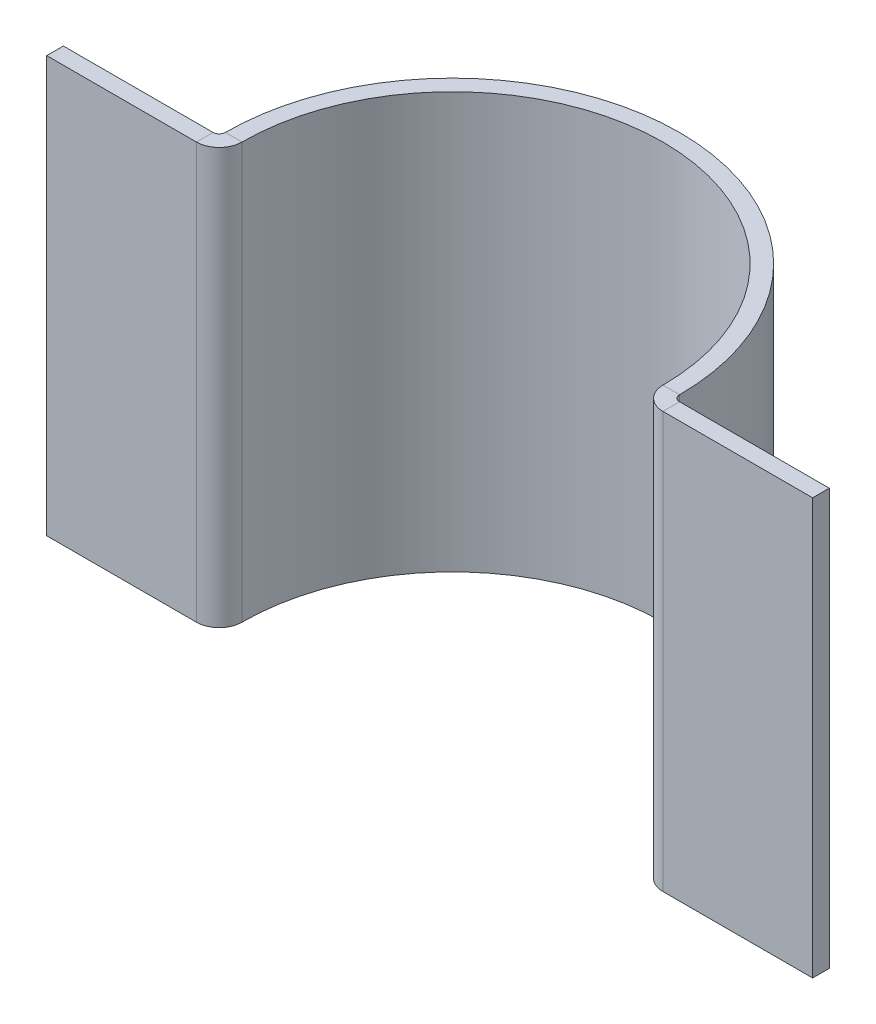
ISO-10303-21;
HEADER;
FILE_DESCRIPTION(('STEP AP214'),'2;1');
FILE_NAME('part.step','',(''),(''),'','','');
FILE_SCHEMA(('AUTOMOTIVE_DESIGN { 1 0 10303 214 1 1 1 1 }'));
ENDSEC;
DATA;
#1=APPLICATION_CONTEXT('core data for automotive mechanical design processes');
#2=APPLICATION_PROTOCOL_DEFINITION('international standard','automotive_design',2000,#1);
#3=PRODUCT_CONTEXT('',#1,'mechanical');
#4=PRODUCT('Part','Part','',(#3));
#5=PRODUCT_RELATED_PRODUCT_CATEGORY('part','',(#4));
#6=PRODUCT_DEFINITION_FORMATION('','',#4);
#7=PRODUCT_DEFINITION_CONTEXT('part definition',#1,'design');
#8=PRODUCT_DEFINITION('design','',#6,#7);
#9=PRODUCT_DEFINITION_SHAPE('','',#8);
#10=(LENGTH_UNIT() NAMED_UNIT(*) SI_UNIT(.MILLI.,.METRE.));
#11=(NAMED_UNIT(*) PLANE_ANGLE_UNIT() SI_UNIT($,.RADIAN.));
#12=(NAMED_UNIT(*) SI_UNIT($,.STERADIAN.) SOLID_ANGLE_UNIT());
#13=UNCERTAINTY_MEASURE_WITH_UNIT(LENGTH_MEASURE(1.E-05),#10,'distance_accuracy_value','');
#14=(GEOMETRIC_REPRESENTATION_CONTEXT(3) GLOBAL_UNCERTAINTY_ASSIGNED_CONTEXT((#13)) GLOBAL_UNIT_ASSIGNED_CONTEXT((#10,
#11,#12)) REPRESENTATION_CONTEXT('',''));
#15=CARTESIAN_POINT('',(0.,0.,0.));
#16=DIRECTION('',(0.,0.,1.));
#17=DIRECTION('',(1.,0.,0.));
#18=AXIS2_PLACEMENT_3D('',#15,#16,#17);
#19=CARTESIAN_POINT('',(0.,50.,0.));
#20=DIRECTION('',(0.,-1.,0.));
#21=DIRECTION('',(0.,0.,-1.));
#22=AXIS2_PLACEMENT_3D('',#19,#20,#21);
#23=CYLINDRICAL_SURFACE('',#22,27.3087417494406);
#24=CARTESIAN_POINT('',(0.,0.,0.));
#25=DIRECTION('',(0.,1.,0.));
#26=DIRECTION('',(1.,0.,0.));
#27=AXIS2_PLACEMENT_3D('',#24,#25,#26);
#28=CIRCLE('',#27,27.3087417494406);
#29=CARTESIAN_POINT('',(27.3087417494406,0.,0.));
#30=VERTEX_POINT('',#29);
#31=CARTESIAN_POINT('',(-27.3087417494406,0.,0.));
#32=VERTEX_POINT('',#31);
#33=EDGE_CURVE('E183',#30,#32,#28,.T.);
#34=ORIENTED_EDGE('',*,*,#33,.T.);
#35=DIRECTION('',(0.,-1.,0.));
#36=VECTOR('',#35,1.);
#37=CARTESIAN_POINT('',(-27.3087417494406,50.,0.));
#38=LINE('',#37,#36);
#39=CARTESIAN_POINT('',(-27.3087417494406,50.,0.));
#40=VERTEX_POINT('',#39);
#41=EDGE_CURVE('E13',#40,#32,#38,.T.);
#42=ORIENTED_EDGE('',*,*,#41,.F.);
#43=CARTESIAN_POINT('',(0.,50.,0.));
#44=DIRECTION('',(0.,1.,0.));
#45=DIRECTION('',(1.,0.,0.));
#46=AXIS2_PLACEMENT_3D('',#43,#44,#45);
#47=CIRCLE('',#46,27.3087417494406);
#48=CARTESIAN_POINT('',(27.3087417494406,50.,0.));
#49=VERTEX_POINT('',#48);
#50=EDGE_CURVE('E95',#49,#40,#47,.T.);
#51=ORIENTED_EDGE('',*,*,#50,.F.);
#52=DIRECTION('',(0.,-1.,0.));
#53=VECTOR('',#52,1.);
#54=CARTESIAN_POINT('',(27.3087417494406,50.,0.));
#55=LINE('',#54,#53);
#56=EDGE_CURVE('E197',#49,#30,#55,.T.);
#57=ORIENTED_EDGE('',*,*,#56,.T.);
#58=EDGE_LOOP('',(#34,#42,#51,#57));
#59=FACE_BOUND('',#58,.T.);
#60=ADVANCED_FACE('F79',(#59),#23,.T.);
#61=CARTESIAN_POINT('',(0.,50.,0.));
#62=DIRECTION('',(0.,-1.,0.));
#63=DIRECTION('',(0.,0.,-1.));
#64=AXIS2_PLACEMENT_3D('',#61,#62,#63);
#65=CYLINDRICAL_SURFACE('',#64,25.3087417494406);
#66=CARTESIAN_POINT('',(0.,0.,0.));
#67=DIRECTION('',(0.,1.,0.));
#68=DIRECTION('',(0.,0.,1.));
#69=AXIS2_PLACEMENT_3D('',#66,#67,#68);
#70=CIRCLE('',#69,25.3087417494406);
#71=CARTESIAN_POINT('',(25.3087417494406,0.,0.));
#72=VERTEX_POINT('',#71);
#73=CARTESIAN_POINT('',(-25.3087417494406,0.,0.));
#74=VERTEX_POINT('',#73);
#75=EDGE_CURVE('E203',#72,#74,#70,.T.);
#76=ORIENTED_EDGE('',*,*,#75,.F.);
#77=DIRECTION('',(0.,-1.,0.));
#78=VECTOR('',#77,1.);
#79=CARTESIAN_POINT('',(25.3087417494406,50.,0.));
#80=LINE('',#79,#78);
#81=CARTESIAN_POINT('',(25.3087417494406,50.,0.));
#82=VERTEX_POINT('',#81);
#83=EDGE_CURVE('E207',#82,#72,#80,.T.);
#84=ORIENTED_EDGE('',*,*,#83,.F.);
#85=CARTESIAN_POINT('',(0.,50.,0.));
#86=DIRECTION('',(0.,1.,0.));
#87=DIRECTION('',(0.,0.,1.));
#88=AXIS2_PLACEMENT_3D('',#85,#86,#87);
#89=CIRCLE('',#88,25.3087417494406);
#90=CARTESIAN_POINT('',(-25.3087417494406,50.,0.));
#91=VERTEX_POINT('',#90);
#92=EDGE_CURVE('E191',#82,#91,#89,.T.);
#93=ORIENTED_EDGE('',*,*,#92,.T.);
#94=DIRECTION('',(0.,-1.,0.));
#95=VECTOR('',#94,1.);
#96=CARTESIAN_POINT('',(-25.3087417494406,50.,0.));
#97=LINE('',#96,#95);
#98=EDGE_CURVE('E87',#91,#74,#97,.T.);
#99=ORIENTED_EDGE('',*,*,#98,.T.);
#100=EDGE_LOOP('',(#76,#84,#93,#99));
#101=FACE_BOUND('',#100,.T.);
#102=ADVANCED_FACE('F211',(#101),#65,.F.);
#103=CARTESIAN_POINT('',(0.,50.,0.));
#104=DIRECTION('',(0.,1.,0.));
#105=DIRECTION('',(1.,0.,0.));
#106=AXIS2_PLACEMENT_3D('',#103,#104,#105);
#107=PLANE('',#106);
#108=ORIENTED_EDGE('',*,*,#50,.T.);
#109=DIRECTION('',(-1.,0.,0.));
#110=VECTOR('',#109,1.);
#111=CARTESIAN_POINT('',(-25.3087417494406,50.,0.));
#112=LINE('',#111,#110);
#113=EDGE_CURVE('E188',#91,#40,#112,.T.);
#114=ORIENTED_EDGE('',*,*,#113,.F.);
#115=ORIENTED_EDGE('',*,*,#92,.F.);
#116=DIRECTION('',(-1.,0.,0.));
#117=VECTOR('',#116,1.);
#118=CARTESIAN_POINT('',(27.3087417494406,50.,0.));
#119=LINE('',#118,#117);
#120=EDGE_CURVE('E194',#49,#82,#119,.T.);
#121=ORIENTED_EDGE('',*,*,#120,.F.);
#122=EDGE_LOOP('',(#108,#114,#115,#121));
#123=FACE_BOUND('',#122,.T.);
#124=ADVANCED_FACE('F331',(#123),#107,.T.);
#125=CARTESIAN_POINT('',(0.,0.,0.));
#126=DIRECTION('',(0.,1.,0.));
#127=DIRECTION('',(1.,0.,0.));
#128=AXIS2_PLACEMENT_3D('',#125,#126,#127);
#129=PLANE('',#128);
#130=ORIENTED_EDGE('',*,*,#33,.F.);
#131=DIRECTION('',(-1.,0.,0.));
#132=VECTOR('',#131,1.);
#133=CARTESIAN_POINT('',(27.3087417494406,0.,0.));
#134=LINE('',#133,#132);
#135=EDGE_CURVE('E116',#30,#72,#134,.T.);
#136=ORIENTED_EDGE('',*,*,#135,.T.);
#137=ORIENTED_EDGE('',*,*,#75,.T.);
#138=DIRECTION('',(-1.,0.,0.));
#139=VECTOR('',#138,1.);
#140=CARTESIAN_POINT('',(-25.3087417494406,0.,0.));
#141=LINE('',#140,#139);
#142=EDGE_CURVE('E200',#74,#32,#141,.T.);
#143=ORIENTED_EDGE('',*,*,#142,.T.);
#144=EDGE_LOOP('',(#130,#136,#137,#143));
#145=FACE_BOUND('',#144,.T.);
#146=ADVANCED_FACE('F216',(#145),#129,.F.);
#147=CARTESIAN_POINT('',(28.0453417494406,50.,0.));
#148=DIRECTION('',(0.,1.,0.));
#149=DIRECTION('',(0.,0.,1.));
#150=AXIS2_PLACEMENT_3D('',#147,#148,#149);
#151=PLANE('',#150);
#152=DIRECTION('',(0.,0.,-1.));
#153=VECTOR('',#152,1.);
#154=CARTESIAN_POINT('',(28.0453417494406,50.,2.7366));
#155=LINE('',#154,#153);
#156=CARTESIAN_POINT('',(28.0453417494406,50.,0.7366));
#157=VERTEX_POINT('',#156);
#158=CARTESIAN_POINT('',(28.0453417494406,50.,2.7366));
#159=VERTEX_POINT('',#158);
#160=EDGE_CURVE('E143',#157,#159,#155,.F.);
#161=ORIENTED_EDGE('',*,*,#160,.F.);
#162=CARTESIAN_POINT('',(28.0453417494406,50.,0.));
#163=DIRECTION('',(0.,-1.,0.));
#164=DIRECTION('',(0.,0.,-1.));
#165=AXIS2_PLACEMENT_3D('',#162,#163,#164);
#166=CIRCLE('',#165,0.736600000000005);
#167=EDGE_CURVE('E137',#49,#157,#166,.F.);
#168=ORIENTED_EDGE('',*,*,#167,.F.);
#169=ORIENTED_EDGE('',*,*,#120,.T.);
#170=CARTESIAN_POINT('',(28.0453417494406,50.,0.));
#171=DIRECTION('',(0.,-1.,0.));
#172=DIRECTION('',(0.,0.,-1.));
#173=AXIS2_PLACEMENT_3D('',#170,#171,#172);
#174=CIRCLE('',#173,2.73660000000001);
#175=EDGE_CURVE('E180',#82,#159,#174,.F.);
#176=ORIENTED_EDGE('',*,*,#175,.T.);
#177=EDGE_LOOP('',(#161,#168,#169,#176));
#178=FACE_BOUND('',#177,.T.);
#179=ADVANCED_FACE('F237',(#178),#151,.T.);
#180=CARTESIAN_POINT('',(28.0453417494406,0.,0.));
#181=DIRECTION('',(0.,1.,0.));
#182=DIRECTION('',(0.,0.,1.));
#183=AXIS2_PLACEMENT_3D('',#180,#181,#182);
#184=PLANE('',#183);
#185=CARTESIAN_POINT('',(28.0453417494406,0.,0.));
#186=DIRECTION('',(0.,-1.,0.));
#187=DIRECTION('',(0.,0.,-1.));
#188=AXIS2_PLACEMENT_3D('',#185,#186,#187);
#189=CIRCLE('',#188,0.736600000000005);
#190=CARTESIAN_POINT('',(28.0453417494406,0.,0.736600000000008));
#191=VERTEX_POINT('',#190);
#192=EDGE_CURVE('E135',#191,#30,#189,.T.);
#193=ORIENTED_EDGE('',*,*,#192,.F.);
#194=DIRECTION('',(0.,0.,-1.));
#195=VECTOR('',#194,1.);
#196=CARTESIAN_POINT('',(28.0453417494406,0.,0.736600000000001));
#197=LINE('',#196,#195);
#198=CARTESIAN_POINT('',(28.0453417494406,0.,2.7366));
#199=VERTEX_POINT('',#198);
#200=EDGE_CURVE('E142',#191,#199,#197,.F.);
#201=ORIENTED_EDGE('',*,*,#200,.T.);
#202=CARTESIAN_POINT('',(28.0453417494406,0.,0.));
#203=DIRECTION('',(0.,-1.,0.));
#204=DIRECTION('',(0.,0.,-1.));
#205=AXIS2_PLACEMENT_3D('',#202,#203,#204);
#206=CIRCLE('',#205,2.73660000000001);
#207=EDGE_CURVE('E184',#199,#72,#206,.T.);
#208=ORIENTED_EDGE('',*,*,#207,.T.);
#209=ORIENTED_EDGE('',*,*,#135,.F.);
#210=EDGE_LOOP('',(#193,#201,#208,#209));
#211=FACE_BOUND('',#210,.T.);
#212=ADVANCED_FACE('F148',(#211),#184,.F.);
#213=CARTESIAN_POINT('',(28.0453417494406,0.,0.));
#214=DIRECTION('',(0.,-1.,0.));
#215=DIRECTION('',(0.,0.,1.));
#216=AXIS2_PLACEMENT_3D('',#213,#214,#215);
#217=CYLINDRICAL_SURFACE('',#216,2.73660000000001);
#218=ORIENTED_EDGE('',*,*,#83,.T.);
#219=ORIENTED_EDGE('',*,*,#207,.F.);
#220=DIRECTION('',(0.,-1.,0.));
#221=VECTOR('',#220,1.);
#222=CARTESIAN_POINT('',(28.0453417494406,50.,2.7366));
#223=LINE('',#222,#221);
#224=EDGE_CURVE('E164',#199,#159,#223,.F.);
#225=ORIENTED_EDGE('',*,*,#224,.T.);
#226=ORIENTED_EDGE('',*,*,#175,.F.);
#227=EDGE_LOOP('',(#218,#219,#225,#226));
#228=FACE_BOUND('',#227,.T.);
#229=ADVANCED_FACE('F328',(#228),#217,.T.);
#230=CARTESIAN_POINT('',(28.0453417494406,0.,0.));
#231=DIRECTION('',(0.,-1.,0.));
#232=DIRECTION('',(0.,0.,1.));
#233=AXIS2_PLACEMENT_3D('',#230,#231,#232);
#234=CYLINDRICAL_SURFACE('',#233,0.736600000000005);
#235=ORIENTED_EDGE('',*,*,#56,.F.);
#236=ORIENTED_EDGE('',*,*,#167,.T.);
#237=DIRECTION('',(0.,-1.,0.));
#238=VECTOR('',#237,1.);
#239=CARTESIAN_POINT('',(28.0453417494406,50.,0.736600000000001));
#240=LINE('',#239,#238);
#241=EDGE_CURVE('E131',#157,#191,#240,.T.);
#242=ORIENTED_EDGE('',*,*,#241,.T.);
#243=ORIENTED_EDGE('',*,*,#192,.T.);
#244=EDGE_LOOP('',(#235,#236,#242,#243));
#245=FACE_BOUND('',#244,.T.);
#246=ADVANCED_FACE('F134',(#245),#234,.F.);
#247=CARTESIAN_POINT('',(27.3087417494406,50.,2.7366));
#248=DIRECTION('',(0.,-1.,0.));
#249=DIRECTION('',(0.,0.,-1.));
#250=AXIS2_PLACEMENT_3D('',#247,#248,#249);
#251=PLANE('',#250);
#252=ORIENTED_EDGE('',*,*,#160,.T.);
#253=DIRECTION('',(-1.,0.,0.));
#254=VECTOR('',#253,1.);
#255=CARTESIAN_POINT('',(0.,50.,2.7365999999999));
#256=LINE('',#255,#254);
#257=CARTESIAN_POINT('',(46.0453417494406,50.,2.73660000000006));
#258=VERTEX_POINT('',#257);
#259=EDGE_CURVE('E172',#258,#159,#256,.T.);
#260=ORIENTED_EDGE('',*,*,#259,.F.);
#261=DIRECTION('',(0.,0.,-1.));
#262=VECTOR('',#261,1.);
#263=CARTESIAN_POINT('',(46.0453417494406,50.,2.73660000000006));
#264=LINE('',#263,#262);
#265=CARTESIAN_POINT('',(46.0453417494406,50.,0.736600000000062));
#266=VERTEX_POINT('',#265);
#267=EDGE_CURVE('E253',#258,#266,#264,.T.);
#268=ORIENTED_EDGE('',*,*,#267,.T.);
#269=DIRECTION('',(1.,0.,0.));
#270=VECTOR('',#269,1.);
#271=CARTESIAN_POINT('',(27.3087417494406,50.,0.736599999999997));
#272=LINE('',#271,#270);
#273=EDGE_CURVE('E170',#266,#157,#272,.F.);
#274=ORIENTED_EDGE('',*,*,#273,.T.);
#275=EDGE_LOOP('',(#252,#260,#268,#274));
#276=FACE_BOUND('',#275,.T.);
#277=ADVANCED_FACE('F242',(#276),#251,.F.);
#278=CARTESIAN_POINT('',(46.0453417494406,0.,2.73660000000006));
#279=DIRECTION('',(0.,1.,0.));
#280=DIRECTION('',(0.,0.,1.));
#281=AXIS2_PLACEMENT_3D('',#278,#279,#280);
#282=PLANE('',#281);
#283=ORIENTED_EDGE('',*,*,#200,.F.);
#284=DIRECTION('',(-1.,0.,0.));
#285=VECTOR('',#284,1.);
#286=CARTESIAN_POINT('',(46.0453417494406,0.,0.736600000000062));
#287=LINE('',#286,#285);
#288=CARTESIAN_POINT('',(46.0453417494406,0.,0.736600000000062));
#289=VERTEX_POINT('',#288);
#290=EDGE_CURVE('E160',#191,#289,#287,.F.);
#291=ORIENTED_EDGE('',*,*,#290,.T.);
#292=DIRECTION('',(0.,0.,-1.));
#293=VECTOR('',#292,1.);
#294=CARTESIAN_POINT('',(46.0453417494406,0.,2.73660000000006));
#295=LINE('',#294,#293);
#296=CARTESIAN_POINT('',(46.0453417494406,0.,2.73660000000006));
#297=VERTEX_POINT('',#296);
#298=EDGE_CURVE('E152',#297,#289,#295,.T.);
#299=ORIENTED_EDGE('',*,*,#298,.F.);
#300=DIRECTION('',(1.,0.,0.));
#301=VECTOR('',#300,1.);
#302=CARTESIAN_POINT('',(0.,0.,2.7365999999999));
#303=LINE('',#302,#301);
#304=EDGE_CURVE('E163',#199,#297,#303,.T.);
#305=ORIENTED_EDGE('',*,*,#304,.F.);
#306=EDGE_LOOP('',(#283,#291,#299,#305));
#307=FACE_BOUND('',#306,.T.);
#308=ADVANCED_FACE('F157',(#307),#282,.F.);
#309=CARTESIAN_POINT('',(0.,0.,2.7365999999999));
#310=DIRECTION('',(0.,0.,-1.));
#311=DIRECTION('',(-1.,0.,0.));
#312=AXIS2_PLACEMENT_3D('',#309,#310,#311);
#313=PLANE('',#312);
#314=ORIENTED_EDGE('',*,*,#224,.F.);
#315=ORIENTED_EDGE('',*,*,#304,.T.);
#316=DIRECTION('',(0.,1.,0.));
#317=VECTOR('',#316,1.);
#318=CARTESIAN_POINT('',(46.0453417494406,0.,2.73660000000006));
#319=LINE('',#318,#317);
#320=EDGE_CURVE('E248',#297,#258,#319,.T.);
#321=ORIENTED_EDGE('',*,*,#320,.T.);
#322=ORIENTED_EDGE('',*,*,#259,.T.);
#323=EDGE_LOOP('',(#314,#315,#321,#322));
#324=FACE_BOUND('',#323,.T.);
#325=ADVANCED_FACE('F246',(#324),#313,.F.);
#326=CARTESIAN_POINT('',(0.,0.,0.736599999999904));
#327=DIRECTION('',(0.,0.,-1.));
#328=DIRECTION('',(-1.,0.,0.));
#329=AXIS2_PLACEMENT_3D('',#326,#327,#328);
#330=PLANE('',#329);
#331=ORIENTED_EDGE('',*,*,#290,.F.);
#332=ORIENTED_EDGE('',*,*,#241,.F.);
#333=ORIENTED_EDGE('',*,*,#273,.F.);
#334=DIRECTION('',(0.,-1.,0.));
#335=VECTOR('',#334,1.);
#336=CARTESIAN_POINT('',(46.0453417494406,50.,0.736600000000062));
#337=LINE('',#336,#335);
#338=EDGE_CURVE('E169',#289,#266,#337,.F.);
#339=ORIENTED_EDGE('',*,*,#338,.F.);
#340=EDGE_LOOP('',(#331,#332,#333,#339));
#341=FACE_BOUND('',#340,.T.);
#342=ADVANCED_FACE('F167',(#341),#330,.T.);
#343=CARTESIAN_POINT('',(46.0453417494406,50.,2.73660000000006));
#344=DIRECTION('',(-1.,0.,0.));
#345=DIRECTION('',(0.,0.,1.));
#346=AXIS2_PLACEMENT_3D('',#343,#344,#345);
#347=PLANE('',#346);
#348=ORIENTED_EDGE('',*,*,#338,.T.);
#349=ORIENTED_EDGE('',*,*,#267,.F.);
#350=ORIENTED_EDGE('',*,*,#320,.F.);
#351=ORIENTED_EDGE('',*,*,#298,.T.);
#352=EDGE_LOOP('',(#348,#349,#350,#351));
#353=FACE_BOUND('',#352,.T.);
#354=ADVANCED_FACE('F376',(#353),#347,.F.);
#355=CARTESIAN_POINT('',(-28.0453417494406,0.,0.));
#356=DIRECTION('',(0.,-1.,0.));
#357=DIRECTION('',(0.,0.,-1.));
#358=AXIS2_PLACEMENT_3D('',#355,#356,#357);
#359=PLANE('',#358);
#360=DIRECTION('',(0.,0.,-1.));
#361=VECTOR('',#360,1.);
#362=CARTESIAN_POINT('',(-28.0453417494406,0.,2.73659999999999));
#363=LINE('',#362,#361);
#364=CARTESIAN_POINT('',(-28.0453417494406,0.,0.736599999999997));
#365=VERTEX_POINT('',#364);
#366=CARTESIAN_POINT('',(-28.0453417494406,0.,2.7366));
#367=VERTEX_POINT('',#366);
#368=EDGE_CURVE('E229',#365,#367,#363,.F.);
#369=ORIENTED_EDGE('',*,*,#368,.F.);
#370=CARTESIAN_POINT('',(-28.0453417494406,0.,0.));
#371=DIRECTION('',(0.,1.,0.));
#372=DIRECTION('',(0.,0.,1.));
#373=AXIS2_PLACEMENT_3D('',#370,#371,#372);
#374=CIRCLE('',#373,0.736600000000001);
#375=EDGE_CURVE('E227',#32,#365,#374,.F.);
#376=ORIENTED_EDGE('',*,*,#375,.F.);
#377=ORIENTED_EDGE('',*,*,#142,.F.);
#378=CARTESIAN_POINT('',(-28.0453417494406,0.,0.));
#379=DIRECTION('',(0.,1.,0.));
#380=DIRECTION('',(0.,0.,1.));
#381=AXIS2_PLACEMENT_3D('',#378,#379,#380);
#382=CIRCLE('',#381,2.7366);
#383=EDGE_CURVE('E107',#74,#367,#382,.F.);
#384=ORIENTED_EDGE('',*,*,#383,.T.);
#385=EDGE_LOOP('',(#369,#376,#377,#384));
#386=FACE_BOUND('',#385,.T.);
#387=ADVANCED_FACE('F224',(#386),#359,.T.);
#388=CARTESIAN_POINT('',(-28.0453417494406,50.,0.));
#389=DIRECTION('',(0.,-1.,0.));
#390=DIRECTION('',(0.,0.,-1.));
#391=AXIS2_PLACEMENT_3D('',#388,#389,#390);
#392=PLANE('',#391);
#393=CARTESIAN_POINT('',(-28.0453417494406,50.,0.));
#394=DIRECTION('',(0.,1.,0.));
#395=DIRECTION('',(0.,0.,1.));
#396=AXIS2_PLACEMENT_3D('',#393,#394,#395);
#397=CIRCLE('',#396,0.736600000000001);
#398=CARTESIAN_POINT('',(-28.0453417494406,50.,0.736600000000001));
#399=VERTEX_POINT('',#398);
#400=EDGE_CURVE('E234',#399,#40,#397,.T.);
#401=ORIENTED_EDGE('',*,*,#400,.F.);
#402=DIRECTION('',(0.,0.,-1.));
#403=VECTOR('',#402,1.);
#404=CARTESIAN_POINT('',(-28.0453417494406,50.,0.736599999999997));
#405=LINE('',#404,#403);
#406=CARTESIAN_POINT('',(-28.0453417494406,50.,2.7366));
#407=VERTEX_POINT('',#406);
#408=EDGE_CURVE('E264',#399,#407,#405,.F.);
#409=ORIENTED_EDGE('',*,*,#408,.T.);
#410=CARTESIAN_POINT('',(-28.0453417494406,50.,0.));
#411=DIRECTION('',(0.,1.,0.));
#412=DIRECTION('',(0.,0.,1.));
#413=AXIS2_PLACEMENT_3D('',#410,#411,#412);
#414=CIRCLE('',#413,2.7366);
#415=EDGE_CURVE('E233',#407,#91,#414,.T.);
#416=ORIENTED_EDGE('',*,*,#415,.T.);
#417=ORIENTED_EDGE('',*,*,#113,.T.);
#418=EDGE_LOOP('',(#401,#409,#416,#417));
#419=FACE_BOUND('',#418,.T.);
#420=ADVANCED_FACE('F334',(#419),#392,.F.);
#421=CARTESIAN_POINT('',(-28.0453417494406,50.,0.));
#422=DIRECTION('',(0.,1.,0.));
#423=DIRECTION('',(0.,0.,1.));
#424=AXIS2_PLACEMENT_3D('',#421,#422,#423);
#425=CYLINDRICAL_SURFACE('',#424,2.7366);
#426=ORIENTED_EDGE('',*,*,#98,.F.);
#427=ORIENTED_EDGE('',*,*,#415,.F.);
#428=DIRECTION('',(0.,1.,0.));
#429=VECTOR('',#428,1.);
#430=CARTESIAN_POINT('',(-28.0453417494406,0.,2.7366));
#431=LINE('',#430,#429);
#432=EDGE_CURVE('E267',#407,#367,#431,.F.);
#433=ORIENTED_EDGE('',*,*,#432,.T.);
#434=ORIENTED_EDGE('',*,*,#383,.F.);
#435=EDGE_LOOP('',(#426,#427,#433,#434));
#436=FACE_BOUND('',#435,.T.);
#437=ADVANCED_FACE('F343',(#436),#425,.T.);
#438=CARTESIAN_POINT('',(-28.0453417494406,50.,0.));
#439=DIRECTION('',(0.,1.,0.));
#440=DIRECTION('',(0.,0.,1.));
#441=AXIS2_PLACEMENT_3D('',#438,#439,#440);
#442=CYLINDRICAL_SURFACE('',#441,0.736600000000001);
#443=ORIENTED_EDGE('',*,*,#41,.T.);
#444=ORIENTED_EDGE('',*,*,#375,.T.);
#445=DIRECTION('',(0.,1.,0.));
#446=VECTOR('',#445,1.);
#447=CARTESIAN_POINT('',(-28.0453417494406,0.,0.736599999999997));
#448=LINE('',#447,#446);
#449=EDGE_CURVE('E262',#365,#399,#448,.T.);
#450=ORIENTED_EDGE('',*,*,#449,.T.);
#451=ORIENTED_EDGE('',*,*,#400,.T.);
#452=EDGE_LOOP('',(#443,#444,#450,#451));
#453=FACE_BOUND('',#452,.T.);
#454=ADVANCED_FACE('F335',(#453),#442,.F.);
#455=CARTESIAN_POINT('',(-46.0453417494406,50.,2.73660000000006));
#456=DIRECTION('',(0.,-1.,0.));
#457=DIRECTION('',(0.,0.,-1.));
#458=AXIS2_PLACEMENT_3D('',#455,#456,#457);
#459=PLANE('',#458);
#460=ORIENTED_EDGE('',*,*,#408,.F.);
#461=DIRECTION('',(1.,0.,0.));
#462=VECTOR('',#461,1.);
#463=CARTESIAN_POINT('',(-46.0453417494406,50.,0.736600000000063));
#464=LINE('',#463,#462);
#465=CARTESIAN_POINT('',(-46.0453417494406,50.,0.736600000000063));
#466=VERTEX_POINT('',#465);
#467=EDGE_CURVE('E269',#399,#466,#464,.F.);
#468=ORIENTED_EDGE('',*,*,#467,.T.);
#469=DIRECTION('',(0.,0.,-1.));
#470=VECTOR('',#469,1.);
#471=CARTESIAN_POINT('',(-46.0453417494406,50.,2.73660000000006));
#472=LINE('',#471,#470);
#473=CARTESIAN_POINT('',(-46.0453417494406,50.,2.73660000000006));
#474=VERTEX_POINT('',#473);
#475=EDGE_CURVE('E257',#474,#466,#472,.T.);
#476=ORIENTED_EDGE('',*,*,#475,.F.);
#477=DIRECTION('',(-1.,0.,0.));
#478=VECTOR('',#477,1.);
#479=CARTESIAN_POINT('',(0.,50.,2.73659999999989));
#480=LINE('',#479,#478);
#481=EDGE_CURVE('E278',#407,#474,#480,.T.);
#482=ORIENTED_EDGE('',*,*,#481,.F.);
#483=EDGE_LOOP('',(#460,#468,#476,#482));
#484=FACE_BOUND('',#483,.T.);
#485=ADVANCED_FACE('F305',(#484),#459,.F.);
#486=CARTESIAN_POINT('',(-27.3087417494406,0.,2.73659999999999));
#487=DIRECTION('',(0.,1.,0.));
#488=DIRECTION('',(0.,0.,1.));
#489=AXIS2_PLACEMENT_3D('',#486,#487,#488);
#490=PLANE('',#489);
#491=ORIENTED_EDGE('',*,*,#368,.T.);
#492=DIRECTION('',(1.,0.,0.));
#493=VECTOR('',#492,1.);
#494=CARTESIAN_POINT('',(0.,0.,2.73659999999989));
#495=LINE('',#494,#493);
#496=CARTESIAN_POINT('',(-46.0453417494406,0.,2.73660000000006));
#497=VERTEX_POINT('',#496);
#498=EDGE_CURVE('E284',#497,#367,#495,.T.);
#499=ORIENTED_EDGE('',*,*,#498,.F.);
#500=DIRECTION('',(0.,0.,-1.));
#501=VECTOR('',#500,1.);
#502=CARTESIAN_POINT('',(-46.0453417494406,0.,2.73660000000006));
#503=LINE('',#502,#501);
#504=CARTESIAN_POINT('',(-46.0453417494406,0.,0.736600000000063));
#505=VERTEX_POINT('',#504);
#506=EDGE_CURVE('E287',#497,#505,#503,.T.);
#507=ORIENTED_EDGE('',*,*,#506,.T.);
#508=DIRECTION('',(-1.,0.,0.));
#509=VECTOR('',#508,1.);
#510=CARTESIAN_POINT('',(-27.3087417494406,0.,0.736599999999994));
#511=LINE('',#510,#509);
#512=EDGE_CURVE('E275',#505,#365,#511,.F.);
#513=ORIENTED_EDGE('',*,*,#512,.T.);
#514=EDGE_LOOP('',(#491,#499,#507,#513));
#515=FACE_BOUND('',#514,.T.);
#516=ADVANCED_FACE('F340',(#515),#490,.F.);
#517=CARTESIAN_POINT('',(0.,0.,2.73659999999989));
#518=DIRECTION('',(0.,0.,-1.));
#519=DIRECTION('',(-1.,0.,0.));
#520=AXIS2_PLACEMENT_3D('',#517,#518,#519);
#521=PLANE('',#520);
#522=ORIENTED_EDGE('',*,*,#432,.F.);
#523=ORIENTED_EDGE('',*,*,#481,.T.);
#524=DIRECTION('',(0.,-1.,0.));
#525=VECTOR('',#524,1.);
#526=CARTESIAN_POINT('',(-46.0453417494406,0.,2.73660000000006));
#527=LINE('',#526,#525);
#528=EDGE_CURVE('E281',#474,#497,#527,.T.);
#529=ORIENTED_EDGE('',*,*,#528,.T.);
#530=ORIENTED_EDGE('',*,*,#498,.T.);
#531=EDGE_LOOP('',(#522,#523,#529,#530));
#532=FACE_BOUND('',#531,.T.);
#533=ADVANCED_FACE('F342',(#532),#521,.F.);
#534=CARTESIAN_POINT('',(0.,0.,0.736599999999894));
#535=DIRECTION('',(0.,0.,-1.));
#536=DIRECTION('',(-1.,0.,0.));
#537=AXIS2_PLACEMENT_3D('',#534,#535,#536);
#538=PLANE('',#537);
#539=ORIENTED_EDGE('',*,*,#467,.F.);
#540=ORIENTED_EDGE('',*,*,#449,.F.);
#541=ORIENTED_EDGE('',*,*,#512,.F.);
#542=DIRECTION('',(0.,1.,0.));
#543=VECTOR('',#542,1.);
#544=CARTESIAN_POINT('',(-46.0453417494406,0.,0.736600000000063));
#545=LINE('',#544,#543);
#546=EDGE_CURVE('E272',#466,#505,#545,.F.);
#547=ORIENTED_EDGE('',*,*,#546,.F.);
#548=EDGE_LOOP('',(#539,#540,#541,#547));
#549=FACE_BOUND('',#548,.T.);
#550=ADVANCED_FACE('F338',(#549),#538,.T.);
#551=CARTESIAN_POINT('',(-46.0453417494406,0.,2.73660000000006));
#552=DIRECTION('',(1.,0.,0.));
#553=DIRECTION('',(0.,0.,-1.));
#554=AXIS2_PLACEMENT_3D('',#551,#552,#553);
#555=PLANE('',#554);
#556=ORIENTED_EDGE('',*,*,#546,.T.);
#557=ORIENTED_EDGE('',*,*,#506,.F.);
#558=ORIENTED_EDGE('',*,*,#528,.F.);
#559=ORIENTED_EDGE('',*,*,#475,.T.);
#560=EDGE_LOOP('',(#556,#557,#558,#559));
#561=FACE_BOUND('',#560,.T.);
#562=ADVANCED_FACE('F295',(#561),#555,.F.);
#563=CLOSED_SHELL('',(#60,#102,#124,#146,#179,#212,#229,#246,#277,#308,#325,#342,#354,#387,#420,
#437,#454,#485,#516,#533,#550,#562));
#564=MANIFOLD_SOLID_BREP('B2',#563);
#565=ADVANCED_BREP_SHAPE_REPRESENTATION('',(#18,#564),#14);
#566=SHAPE_DEFINITION_REPRESENTATION(#9,#565);
ENDSEC;
END-ISO-10303-21;
